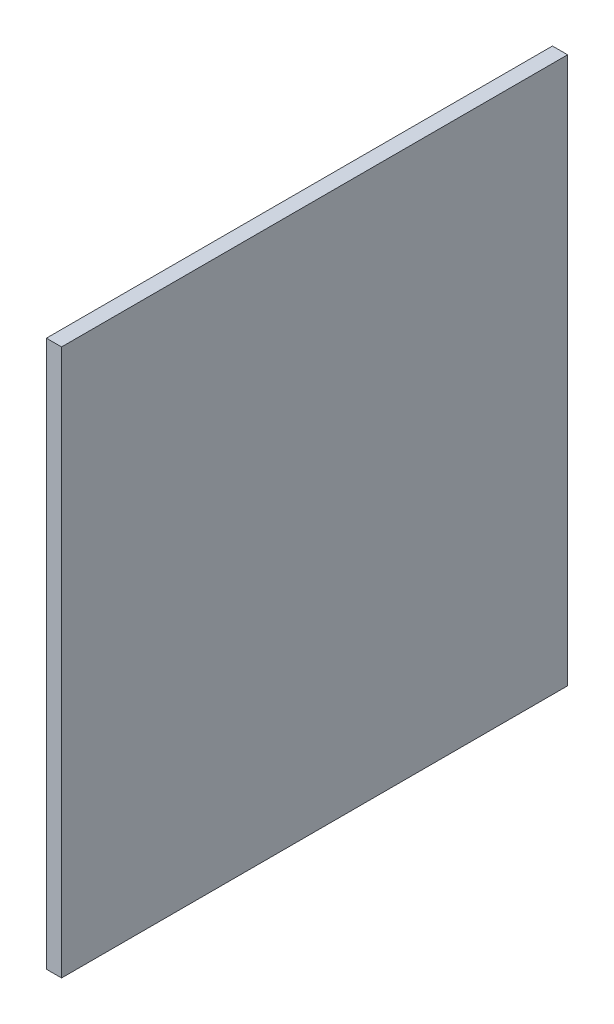
ISO-10303-21;
HEADER;
FILE_DESCRIPTION(('STEP AP214'),'2;1');
FILE_NAME('part.step','',(''),(''),'','','');
FILE_SCHEMA(('AUTOMOTIVE_DESIGN { 1 0 10303 214 1 1 1 1 }'));
ENDSEC;
DATA;
#1=APPLICATION_CONTEXT('core data for automotive mechanical design processes');
#2=APPLICATION_PROTOCOL_DEFINITION('international standard','automotive_design',2000,#1);
#3=PRODUCT_CONTEXT('',#1,'mechanical');
#4=PRODUCT('Part','Part','',(#3));
#5=PRODUCT_RELATED_PRODUCT_CATEGORY('part','',(#4));
#6=PRODUCT_DEFINITION_FORMATION('','',#4);
#7=PRODUCT_DEFINITION_CONTEXT('part definition',#1,'design');
#8=PRODUCT_DEFINITION('design','',#6,#7);
#9=PRODUCT_DEFINITION_SHAPE('','',#8);
#10=(LENGTH_UNIT() NAMED_UNIT(*) SI_UNIT(.MILLI.,.METRE.));
#11=(NAMED_UNIT(*) PLANE_ANGLE_UNIT() SI_UNIT($,.RADIAN.));
#12=(NAMED_UNIT(*) SI_UNIT($,.STERADIAN.) SOLID_ANGLE_UNIT());
#13=UNCERTAINTY_MEASURE_WITH_UNIT(LENGTH_MEASURE(1.E-05),#10,'distance_accuracy_value','');
#14=(GEOMETRIC_REPRESENTATION_CONTEXT(3) GLOBAL_UNCERTAINTY_ASSIGNED_CONTEXT((#13)) GLOBAL_UNIT_ASSIGNED_CONTEXT((#10,
#11,#12)) REPRESENTATION_CONTEXT('',''));
#15=CARTESIAN_POINT('',(0.,0.,0.));
#16=DIRECTION('',(0.,0.,1.));
#17=DIRECTION('',(1.,0.,0.));
#18=AXIS2_PLACEMENT_3D('',#15,#16,#17);
#19=CARTESIAN_POINT('',(0.749999999999997,27.,-25.));
#20=DIRECTION('',(-1.,0.,0.));
#21=DIRECTION('',(0.,0.,1.));
#22=AXIS2_PLACEMENT_3D('',#19,#20,#21);
#23=PLANE('',#22);
#24=DIRECTION('',(0.,0.,-1.));
#25=VECTOR('',#24,1.);
#26=CARTESIAN_POINT('',(0.749999999999997,-27.,-25.));
#27=LINE('',#26,#25);
#28=CARTESIAN_POINT('',(0.750000000000002,-27.,25.));
#29=VERTEX_POINT('',#28);
#30=CARTESIAN_POINT('',(0.749999999999997,-27.,-25.));
#31=VERTEX_POINT('',#30);
#32=EDGE_CURVE('E96',#29,#31,#27,.T.);
#33=ORIENTED_EDGE('',*,*,#32,.T.);
#34=DIRECTION('',(0.,-1.,0.));
#35=VECTOR('',#34,1.);
#36=CARTESIAN_POINT('',(0.749999999999997,27.,-25.));
#37=LINE('',#36,#35);
#38=CARTESIAN_POINT('',(0.749999999999997,27.,-25.));
#39=VERTEX_POINT('',#38);
#40=EDGE_CURVE('E11',#39,#31,#37,.T.);
#41=ORIENTED_EDGE('',*,*,#40,.F.);
#42=DIRECTION('',(0.,0.,-1.));
#43=VECTOR('',#42,1.);
#44=CARTESIAN_POINT('',(0.749999999999997,27.,-25.));
#45=LINE('',#44,#43);
#46=CARTESIAN_POINT('',(0.750000000000002,27.,25.));
#47=VERTEX_POINT('',#46);
#48=EDGE_CURVE('E84',#47,#39,#45,.T.);
#49=ORIENTED_EDGE('',*,*,#48,.F.);
#50=DIRECTION('',(0.,-1.,0.));
#51=VECTOR('',#50,1.);
#52=CARTESIAN_POINT('',(0.750000000000002,27.,25.));
#53=LINE('',#52,#51);
#54=EDGE_CURVE('E92',#47,#29,#53,.T.);
#55=ORIENTED_EDGE('',*,*,#54,.T.);
#56=EDGE_LOOP('',(#33,#41,#49,#55));
#57=FACE_BOUND('',#56,.T.);
#58=ADVANCED_FACE('F33',(#57),#23,.F.);
#59=CARTESIAN_POINT('',(-0.750000000000002,27.,-25.));
#60=DIRECTION('',(0.,0.,1.));
#61=DIRECTION('',(1.,0.,0.));
#62=AXIS2_PLACEMENT_3D('',#59,#60,#61);
#63=PLANE('',#62);
#64=DIRECTION('',(-1.,0.,0.));
#65=VECTOR('',#64,1.);
#66=CARTESIAN_POINT('',(-0.750000000000002,-27.,-25.));
#67=LINE('',#66,#65);
#68=CARTESIAN_POINT('',(-0.750000000000002,-27.,-25.));
#69=VERTEX_POINT('',#68);
#70=EDGE_CURVE('E88',#31,#69,#67,.T.);
#71=ORIENTED_EDGE('',*,*,#70,.T.);
#72=DIRECTION('',(0.,-1.,0.));
#73=VECTOR('',#72,1.);
#74=CARTESIAN_POINT('',(-0.750000000000002,27.,-25.));
#75=LINE('',#74,#73);
#76=CARTESIAN_POINT('',(-0.750000000000002,27.,-25.));
#77=VERTEX_POINT('',#76);
#78=EDGE_CURVE('E41',#77,#69,#75,.T.);
#79=ORIENTED_EDGE('',*,*,#78,.F.);
#80=DIRECTION('',(-1.,0.,0.));
#81=VECTOR('',#80,1.);
#82=CARTESIAN_POINT('',(-0.750000000000002,27.,-25.));
#83=LINE('',#82,#81);
#84=EDGE_CURVE('E79',#39,#77,#83,.T.);
#85=ORIENTED_EDGE('',*,*,#84,.F.);
#86=ORIENTED_EDGE('',*,*,#40,.T.);
#87=EDGE_LOOP('',(#71,#79,#85,#86));
#88=FACE_BOUND('',#87,.T.);
#89=ADVANCED_FACE('F87',(#88),#63,.F.);
#90=CARTESIAN_POINT('',(-0.750000000000002,27.,-25.));
#91=DIRECTION('',(1.,0.,0.));
#92=DIRECTION('',(0.,0.,-1.));
#93=AXIS2_PLACEMENT_3D('',#90,#91,#92);
#94=PLANE('',#93);
#95=DIRECTION('',(0.,0.,1.));
#96=VECTOR('',#95,1.);
#97=CARTESIAN_POINT('',(-0.750000000000002,-27.,-25.));
#98=LINE('',#97,#96);
#99=CARTESIAN_POINT('',(-0.749999999999997,-27.,25.));
#100=VERTEX_POINT('',#99);
#101=EDGE_CURVE('E66',#69,#100,#98,.T.);
#102=ORIENTED_EDGE('',*,*,#101,.T.);
#103=DIRECTION('',(0.,-1.,0.));
#104=VECTOR('',#103,1.);
#105=CARTESIAN_POINT('',(-0.749999999999997,27.,25.));
#106=LINE('',#105,#104);
#107=CARTESIAN_POINT('',(-0.749999999999997,27.,25.));
#108=VERTEX_POINT('',#107);
#109=EDGE_CURVE('E89',#108,#100,#106,.T.);
#110=ORIENTED_EDGE('',*,*,#109,.F.);
#111=DIRECTION('',(0.,0.,1.));
#112=VECTOR('',#111,1.);
#113=CARTESIAN_POINT('',(-0.750000000000002,27.,-25.));
#114=LINE('',#113,#112);
#115=EDGE_CURVE('E82',#77,#108,#114,.T.);
#116=ORIENTED_EDGE('',*,*,#115,.F.);
#117=ORIENTED_EDGE('',*,*,#78,.T.);
#118=EDGE_LOOP('',(#102,#110,#116,#117));
#119=FACE_BOUND('',#118,.T.);
#120=ADVANCED_FACE('F90',(#119),#94,.F.);
#121=CARTESIAN_POINT('',(-0.749999999999997,27.,25.));
#122=DIRECTION('',(0.,0.,-1.));
#123=DIRECTION('',(-1.,0.,0.));
#124=AXIS2_PLACEMENT_3D('',#121,#122,#123);
#125=PLANE('',#124);
#126=DIRECTION('',(1.,0.,0.));
#127=VECTOR('',#126,1.);
#128=CARTESIAN_POINT('',(-0.749999999999997,-27.,25.));
#129=LINE('',#128,#127);
#130=EDGE_CURVE('E72',#100,#29,#129,.T.);
#131=ORIENTED_EDGE('',*,*,#130,.T.);
#132=ORIENTED_EDGE('',*,*,#54,.F.);
#133=DIRECTION('',(1.,0.,0.));
#134=VECTOR('',#133,1.);
#135=CARTESIAN_POINT('',(-0.749999999999997,27.,25.));
#136=LINE('',#135,#134);
#137=EDGE_CURVE('E49',#108,#47,#136,.T.);
#138=ORIENTED_EDGE('',*,*,#137,.F.);
#139=ORIENTED_EDGE('',*,*,#109,.T.);
#140=EDGE_LOOP('',(#131,#132,#138,#139));
#141=FACE_BOUND('',#140,.T.);
#142=ADVANCED_FACE('F103',(#141),#125,.F.);
#143=CARTESIAN_POINT('',(0.,27.,0.));
#144=DIRECTION('',(0.,1.,0.));
#145=DIRECTION('',(0.,0.,1.));
#146=AXIS2_PLACEMENT_3D('',#143,#144,#145);
#147=PLANE('',#146);
#148=ORIENTED_EDGE('',*,*,#48,.T.);
#149=ORIENTED_EDGE('',*,*,#84,.T.);
#150=ORIENTED_EDGE('',*,*,#115,.T.);
#151=ORIENTED_EDGE('',*,*,#137,.T.);
#152=EDGE_LOOP('',(#148,#149,#150,#151));
#153=FACE_BOUND('',#152,.T.);
#154=ADVANCED_FACE('F80',(#153),#147,.T.);
#155=CARTESIAN_POINT('',(0.,-27.,0.));
#156=DIRECTION('',(0.,1.,0.));
#157=DIRECTION('',(0.,0.,1.));
#158=AXIS2_PLACEMENT_3D('',#155,#156,#157);
#159=PLANE('',#158);
#160=ORIENTED_EDGE('',*,*,#32,.F.);
#161=ORIENTED_EDGE('',*,*,#130,.F.);
#162=ORIENTED_EDGE('',*,*,#101,.F.);
#163=ORIENTED_EDGE('',*,*,#70,.F.);
#164=EDGE_LOOP('',(#160,#161,#162,#163));
#165=FACE_BOUND('',#164,.T.);
#166=ADVANCED_FACE('F106',(#165),#159,.F.);
#167=CLOSED_SHELL('',(#58,#89,#120,#142,#154,#166));
#168=MANIFOLD_SOLID_BREP('B2',#167);
#169=ADVANCED_BREP_SHAPE_REPRESENTATION('',(#18,#168),#14);
#170=SHAPE_DEFINITION_REPRESENTATION(#9,#169);
ENDSEC;
END-ISO-10303-21;
